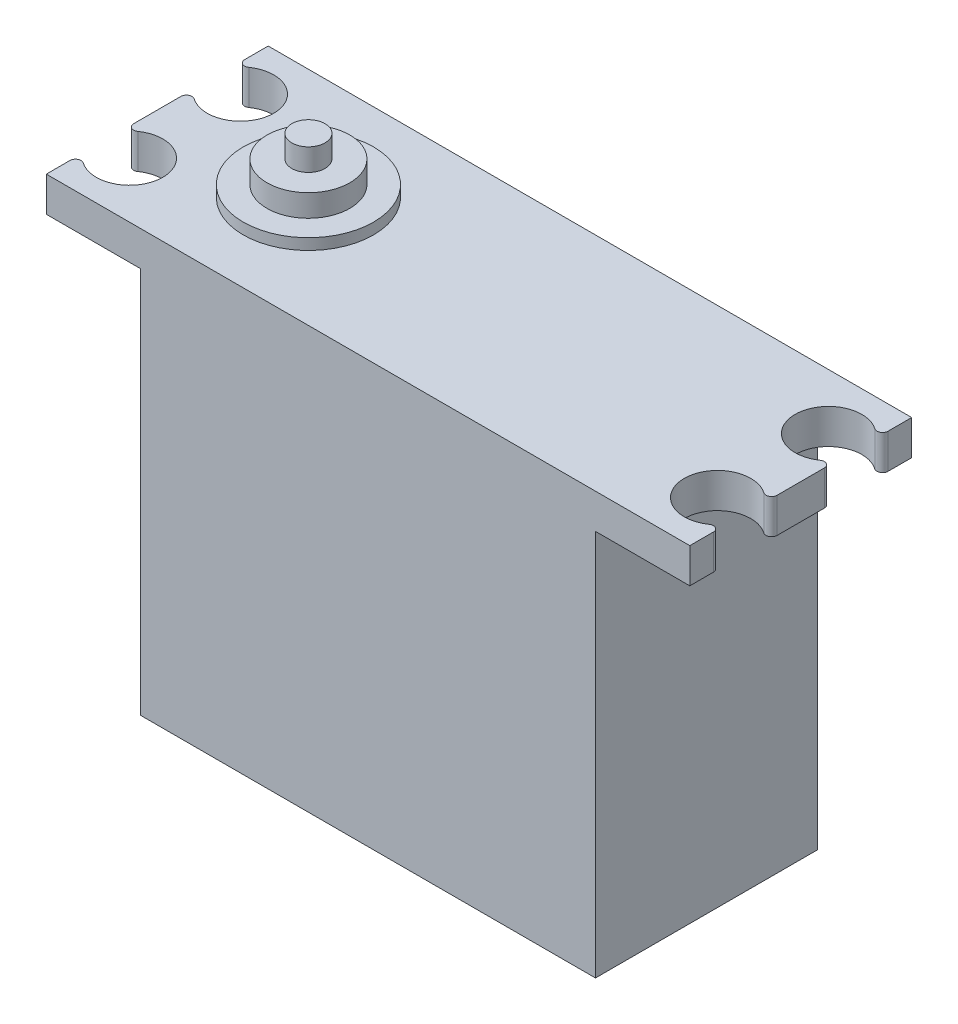
ISO-10303-21;
HEADER;
FILE_DESCRIPTION(('STEP AP214'),'2;1');
FILE_NAME('part.step','',(''),(''),'','','');
FILE_SCHEMA(('AUTOMOTIVE_DESIGN { 1 0 10303 214 1 1 1 1 }'));
ENDSEC;
DATA;
#1=APPLICATION_CONTEXT('core data for automotive mechanical design processes');
#2=APPLICATION_PROTOCOL_DEFINITION('international standard','automotive_design',2000,#1);
#3=PRODUCT_CONTEXT('',#1,'mechanical');
#4=PRODUCT('Part','Part','',(#3));
#5=PRODUCT_RELATED_PRODUCT_CATEGORY('part','',(#4));
#6=PRODUCT_DEFINITION_FORMATION('','',#4);
#7=PRODUCT_DEFINITION_CONTEXT('part definition',#1,'design');
#8=PRODUCT_DEFINITION('design','',#6,#7);
#9=PRODUCT_DEFINITION_SHAPE('','',#8);
#10=(LENGTH_UNIT() NAMED_UNIT(*) SI_UNIT(.MILLI.,.METRE.));
#11=(NAMED_UNIT(*) PLANE_ANGLE_UNIT() SI_UNIT($,.RADIAN.));
#12=(NAMED_UNIT(*) SI_UNIT($,.STERADIAN.) SOLID_ANGLE_UNIT());
#13=UNCERTAINTY_MEASURE_WITH_UNIT(LENGTH_MEASURE(1.E-05),#10,'distance_accuracy_value','');
#14=(GEOMETRIC_REPRESENTATION_CONTEXT(3) GLOBAL_UNCERTAINTY_ASSIGNED_CONTEXT((#13)) GLOBAL_UNIT_ASSIGNED_CONTEXT((#10,
#11,#12)) REPRESENTATION_CONTEXT('',''));
#15=CARTESIAN_POINT('',(0.,0.,0.));
#16=DIRECTION('',(0.,0.,1.));
#17=DIRECTION('',(1.,0.,0.));
#18=AXIS2_PLACEMENT_3D('',#15,#16,#17);
#19=CARTESIAN_POINT('',(-29.,19.,-20.));
#20=DIRECTION('',(-1.,0.,0.));
#21=DIRECTION('',(0.,0.,1.));
#22=AXIS2_PLACEMENT_3D('',#19,#20,#21);
#23=PLANE('',#22);
#24=DIRECTION('',(0.,0.,1.));
#25=VECTOR('',#24,1.);
#26=CARTESIAN_POINT('',(-29.,19.,-20.));
#27=LINE('',#26,#25);
#28=CARTESIAN_POINT('',(-29.,19.,-12.127718676731));
#29=VERTEX_POINT('',#28);
#30=CARTESIAN_POINT('',(-29.,19.,-7.87228132326901));
#31=VERTEX_POINT('',#30);
#32=EDGE_CURVE('E264',#29,#31,#27,.T.);
#33=ORIENTED_EDGE('',*,*,#32,.F.);
#34=DIRECTION('',(0.,-1.,0.));
#35=VECTOR('',#34,1.);
#36=CARTESIAN_POINT('',(-29.,15.8627330351919,-12.127718676731));
#37=LINE('',#36,#35);
#38=CARTESIAN_POINT('',(-29.,15.8627330351919,-12.127718676731));
#39=VERTEX_POINT('',#38);
#40=EDGE_CURVE('E326',#29,#39,#37,.T.);
#41=ORIENTED_EDGE('',*,*,#40,.T.);
#42=DIRECTION('',(0.,0.,1.));
#43=VECTOR('',#42,1.);
#44=CARTESIAN_POINT('',(-29.,15.8627330351919,-20.));
#45=LINE('',#44,#43);
#46=CARTESIAN_POINT('',(-29.,15.8627330351919,-7.87228132326901));
#47=VERTEX_POINT('',#46);
#48=EDGE_CURVE('E216',#39,#47,#45,.T.);
#49=ORIENTED_EDGE('',*,*,#48,.T.);
#50=DIRECTION('',(0.,-1.,0.));
#51=VECTOR('',#50,1.);
#52=CARTESIAN_POINT('',(-29.,19.,-7.87228132326901));
#53=LINE('',#52,#51);
#54=EDGE_CURVE('E324',#47,#31,#53,.F.);
#55=ORIENTED_EDGE('',*,*,#54,.T.);
#56=EDGE_LOOP('',(#33,#41,#49,#55));
#57=FACE_BOUND('',#56,.T.);
#58=ADVANCED_FACE('F34',(#57),#23,.T.);
#59=CARTESIAN_POINT('',(-29.,19.,-2.127718676731));
#60=VERTEX_POINT('',#59);
#61=CARTESIAN_POINT('',(-29.,19.,0.));
#62=VERTEX_POINT('',#61);
#63=EDGE_CURVE('E265',#60,#62,#27,.T.);
#64=ORIENTED_EDGE('',*,*,#63,.F.);
#65=DIRECTION('',(0.,-1.,0.));
#66=VECTOR('',#65,1.);
#67=CARTESIAN_POINT('',(-29.,15.8627330351919,-2.12771867673099));
#68=LINE('',#67,#66);
#69=CARTESIAN_POINT('',(-29.,15.8627330351919,-2.127718676731));
#70=VERTEX_POINT('',#69);
#71=EDGE_CURVE('E334',#60,#70,#68,.T.);
#72=ORIENTED_EDGE('',*,*,#71,.T.);
#73=CARTESIAN_POINT('',(-29.,15.8627330351919,0.));
#74=VERTEX_POINT('',#73);
#75=EDGE_CURVE('E218',#70,#74,#45,.T.);
#76=ORIENTED_EDGE('',*,*,#75,.T.);
#77=DIRECTION('',(0.,-1.,0.));
#78=VECTOR('',#77,1.);
#79=CARTESIAN_POINT('',(-29.,19.,0.));
#80=LINE('',#79,#78);
#81=EDGE_CURVE('E244',#62,#74,#80,.T.);
#82=ORIENTED_EDGE('',*,*,#81,.F.);
#83=EDGE_LOOP('',(#64,#72,#76,#82));
#84=FACE_BOUND('',#83,.T.);
#85=ADVANCED_FACE('F453',(#84),#23,.T.);
#86=CARTESIAN_POINT('',(29.,19.,-20.));
#87=DIRECTION('',(-1.,0.,0.));
#88=DIRECTION('',(0.,0.,1.));
#89=AXIS2_PLACEMENT_3D('',#86,#87,#88);
#90=PLANE('',#89);
#91=DIRECTION('',(0.,0.,1.));
#92=VECTOR('',#91,1.);
#93=CARTESIAN_POINT('',(29.,15.8627330351919,-20.));
#94=LINE('',#93,#92);
#95=CARTESIAN_POINT('',(29.,15.8627330351919,-12.127718676731));
#96=VERTEX_POINT('',#95);
#97=CARTESIAN_POINT('',(29.,15.8627330351919,-7.87228132326901));
#98=VERTEX_POINT('',#97);
#99=EDGE_CURVE('E274',#96,#98,#94,.T.);
#100=ORIENTED_EDGE('',*,*,#99,.F.);
#101=DIRECTION('',(0.,1.,0.));
#102=VECTOR('',#101,1.);
#103=CARTESIAN_POINT('',(29.,19.,-12.127718676731));
#104=LINE('',#103,#102);
#105=CARTESIAN_POINT('',(29.,19.,-12.127718676731));
#106=VERTEX_POINT('',#105);
#107=EDGE_CURVE('E339',#96,#106,#104,.T.);
#108=ORIENTED_EDGE('',*,*,#107,.T.);
#109=DIRECTION('',(0.,0.,1.));
#110=VECTOR('',#109,1.);
#111=CARTESIAN_POINT('',(29.,19.,-20.));
#112=LINE('',#111,#110);
#113=CARTESIAN_POINT('',(29.,19.,-7.87228132326901));
#114=VERTEX_POINT('',#113);
#115=EDGE_CURVE('E269',#106,#114,#112,.T.);
#116=ORIENTED_EDGE('',*,*,#115,.T.);
#117=DIRECTION('',(0.,1.,0.));
#118=VECTOR('',#117,1.);
#119=CARTESIAN_POINT('',(29.,19.,-7.87228132326901));
#120=LINE('',#119,#118);
#121=EDGE_CURVE('E336',#114,#98,#120,.F.);
#122=ORIENTED_EDGE('',*,*,#121,.T.);
#123=EDGE_LOOP('',(#100,#108,#116,#122));
#124=FACE_BOUND('',#123,.T.);
#125=ADVANCED_FACE('F374',(#124),#90,.F.);
#126=CARTESIAN_POINT('',(29.,15.8627330351919,-2.12771867673099));
#127=VERTEX_POINT('',#126);
#128=CARTESIAN_POINT('',(29.,15.8627330351919,0.));
#129=VERTEX_POINT('',#128);
#130=EDGE_CURVE('E275',#127,#129,#94,.T.);
#131=ORIENTED_EDGE('',*,*,#130,.F.);
#132=DIRECTION('',(0.,1.,0.));
#133=VECTOR('',#132,1.);
#134=CARTESIAN_POINT('',(29.,19.,-2.12771867673099));
#135=LINE('',#134,#133);
#136=CARTESIAN_POINT('',(29.,19.,-2.12771867673099));
#137=VERTEX_POINT('',#136);
#138=EDGE_CURVE('E42',#127,#137,#135,.T.);
#139=ORIENTED_EDGE('',*,*,#138,.T.);
#140=CARTESIAN_POINT('',(29.,19.,0.));
#141=VERTEX_POINT('',#140);
#142=EDGE_CURVE('E270',#137,#141,#112,.T.);
#143=ORIENTED_EDGE('',*,*,#142,.T.);
#144=DIRECTION('',(0.,-1.,0.));
#145=VECTOR('',#144,1.);
#146=CARTESIAN_POINT('',(29.,19.,0.));
#147=LINE('',#146,#145);
#148=EDGE_CURVE('E226',#141,#129,#147,.T.);
#149=ORIENTED_EDGE('',*,*,#148,.T.);
#150=EDGE_LOOP('',(#131,#139,#143,#149));
#151=FACE_BOUND('',#150,.T.);
#152=ADVANCED_FACE('F362',(#151),#90,.F.);
#153=CARTESIAN_POINT('',(-29.,15.8627330351919,-20.));
#154=VERTEX_POINT('',#153);
#155=CARTESIAN_POINT('',(-29.,15.8627330351919,-17.872281323269));
#156=VERTEX_POINT('',#155);
#157=EDGE_CURVE('E209',#154,#156,#45,.T.);
#158=ORIENTED_EDGE('',*,*,#157,.T.);
#159=DIRECTION('',(0.,-1.,0.));
#160=VECTOR('',#159,1.);
#161=CARTESIAN_POINT('',(-29.,19.,-17.872281323269));
#162=LINE('',#161,#160);
#163=CARTESIAN_POINT('',(-29.,19.,-17.872281323269));
#164=VERTEX_POINT('',#163);
#165=EDGE_CURVE('E306',#156,#164,#162,.F.);
#166=ORIENTED_EDGE('',*,*,#165,.T.);
#167=CARTESIAN_POINT('',(-29.,19.,-20.));
#168=VERTEX_POINT('',#167);
#169=EDGE_CURVE('E221',#168,#164,#27,.T.);
#170=ORIENTED_EDGE('',*,*,#169,.F.);
#171=DIRECTION('',(0.,-1.,0.));
#172=VECTOR('',#171,1.);
#173=CARTESIAN_POINT('',(-29.,19.,-20.));
#174=LINE('',#173,#172);
#175=EDGE_CURVE('E201',#168,#154,#174,.T.);
#176=ORIENTED_EDGE('',*,*,#175,.T.);
#177=EDGE_LOOP('',(#158,#166,#170,#176));
#178=FACE_BOUND('',#177,.T.);
#179=ADVANCED_FACE('F219',(#178),#23,.T.);
#180=CARTESIAN_POINT('',(-29.,19.,-20.));
#181=DIRECTION('',(0.,-1.,0.));
#182=DIRECTION('',(1.,0.,0.));
#183=AXIS2_PLACEMENT_3D('',#180,#181,#182);
#184=PLANE('',#183);
#185=CARTESIAN_POINT('',(-15.3757931844889,19.,-10.));
#186=DIRECTION('',(0.,-1.,0.));
#187=DIRECTION('',(1.,0.,0.));
#188=AXIS2_PLACEMENT_3D('',#185,#186,#187);
#189=CIRCLE('',#188,5.87207867230453);
#190=CARTESIAN_POINT('',(-9.50371451218433,19.,-10.));
#191=VERTEX_POINT('',#190);
#192=EDGE_CURVE('E11',#191,#191,#189,.F.);
#193=ORIENTED_EDGE('',*,*,#192,.F.);
#194=EDGE_LOOP('',(#193));
#195=FACE_BOUND('',#194,.T.);
#196=ORIENTED_EDGE('',*,*,#169,.T.);
#197=CARTESIAN_POINT('',(-28.5,19.,-17.872281323269));
#198=DIRECTION('',(0.,-1.,0.));
#199=DIRECTION('',(1.,0.,0.));
#200=AXIS2_PLACEMENT_3D('',#197,#198,#199);
#201=CIRCLE('',#200,0.5);
#202=CARTESIAN_POINT('',(-28.2142857142857,19.,-17.4619554199449));
#203=VERTEX_POINT('',#202);
#204=EDGE_CURVE('E322',#164,#203,#201,.F.);
#205=ORIENTED_EDGE('',*,*,#204,.T.);
#206=CARTESIAN_POINT('',(-26.5,19.,-15.));
#207=DIRECTION('',(0.,1.,0.));
#208=DIRECTION('',(-1.,0.,0.));
#209=AXIS2_PLACEMENT_3D('',#206,#207,#208);
#210=CIRCLE('',#209,3.);
#211=CARTESIAN_POINT('',(-28.2142857142857,19.,-12.5380445800551));
#212=VERTEX_POINT('',#211);
#213=EDGE_CURVE('E390',#212,#203,#210,.T.);
#214=ORIENTED_EDGE('',*,*,#213,.F.);
#215=CARTESIAN_POINT('',(-28.5,19.,-12.127718676731));
#216=DIRECTION('',(0.,-1.,0.));
#217=DIRECTION('',(1.,0.,0.));
#218=AXIS2_PLACEMENT_3D('',#215,#216,#217);
#219=CIRCLE('',#218,0.5);
#220=EDGE_CURVE('E320',#212,#29,#219,.F.);
#221=ORIENTED_EDGE('',*,*,#220,.T.);
#222=ORIENTED_EDGE('',*,*,#32,.T.);
#223=CARTESIAN_POINT('',(-28.5,19.,-7.87228132326901));
#224=DIRECTION('',(0.,-1.,0.));
#225=DIRECTION('',(1.,0.,0.));
#226=AXIS2_PLACEMENT_3D('',#223,#224,#225);
#227=CIRCLE('',#226,0.5);
#228=CARTESIAN_POINT('',(-28.2142857142857,19.,-7.46195541994487));
#229=VERTEX_POINT('',#228);
#230=EDGE_CURVE('E318',#31,#229,#227,.F.);
#231=ORIENTED_EDGE('',*,*,#230,.T.);
#232=CARTESIAN_POINT('',(-26.5,19.,-5.));
#233=DIRECTION('',(0.,1.,0.));
#234=DIRECTION('',(1.,0.,0.));
#235=AXIS2_PLACEMENT_3D('',#232,#233,#234);
#236=CIRCLE('',#235,3.);
#237=CARTESIAN_POINT('',(-28.2142857142857,19.,-2.53804458005514));
#238=VERTEX_POINT('',#237);
#239=EDGE_CURVE('E385',#238,#229,#236,.T.);
#240=ORIENTED_EDGE('',*,*,#239,.F.);
#241=CARTESIAN_POINT('',(-28.5,19.,-2.12771867673099));
#242=DIRECTION('',(0.,-1.,0.));
#243=DIRECTION('',(1.,0.,0.));
#244=AXIS2_PLACEMENT_3D('',#241,#242,#243);
#245=CIRCLE('',#244,0.5);
#246=EDGE_CURVE('E316',#238,#60,#245,.F.);
#247=ORIENTED_EDGE('',*,*,#246,.T.);
#248=ORIENTED_EDGE('',*,*,#63,.T.);
#249=DIRECTION('',(1.,0.,0.));
#250=VECTOR('',#249,1.);
#251=CARTESIAN_POINT('',(-29.,19.,0.));
#252=LINE('',#251,#250);
#253=EDGE_CURVE('E223',#62,#141,#252,.T.);
#254=ORIENTED_EDGE('',*,*,#253,.T.);
#255=ORIENTED_EDGE('',*,*,#142,.F.);
#256=CARTESIAN_POINT('',(28.5,19.,-2.12771867673099));
#257=DIRECTION('',(0.,-1.,0.));
#258=DIRECTION('',(1.,0.,0.));
#259=AXIS2_PLACEMENT_3D('',#256,#257,#258);
#260=CIRCLE('',#259,0.5);
#261=CARTESIAN_POINT('',(28.2142857142857,19.,-2.53804458005513));
#262=VERTEX_POINT('',#261);
#263=EDGE_CURVE('E308',#137,#262,#260,.F.);
#264=ORIENTED_EDGE('',*,*,#263,.T.);
#265=CARTESIAN_POINT('',(26.5,19.,-5.));
#266=DIRECTION('',(0.,1.,0.));
#267=DIRECTION('',(-1.,0.,0.));
#268=AXIS2_PLACEMENT_3D('',#265,#266,#267);
#269=CIRCLE('',#268,3.);
#270=CARTESIAN_POINT('',(28.2142857142857,19.,-7.46195541994487));
#271=VERTEX_POINT('',#270);
#272=EDGE_CURVE('E229',#271,#262,#269,.T.);
#273=ORIENTED_EDGE('',*,*,#272,.F.);
#274=CARTESIAN_POINT('',(28.5,19.,-7.87228132326901));
#275=DIRECTION('',(0.,-1.,0.));
#276=DIRECTION('',(1.,0.,0.));
#277=AXIS2_PLACEMENT_3D('',#274,#275,#276);
#278=CIRCLE('',#277,0.5);
#279=EDGE_CURVE('E310',#271,#114,#278,.F.);
#280=ORIENTED_EDGE('',*,*,#279,.T.);
#281=ORIENTED_EDGE('',*,*,#115,.F.);
#282=CARTESIAN_POINT('',(28.5,19.,-12.127718676731));
#283=DIRECTION('',(0.,-1.,0.));
#284=DIRECTION('',(1.,0.,0.));
#285=AXIS2_PLACEMENT_3D('',#282,#283,#284);
#286=CIRCLE('',#285,0.5);
#287=CARTESIAN_POINT('',(28.2142857142857,19.,-12.5380445800551));
#288=VERTEX_POINT('',#287);
#289=EDGE_CURVE('E314',#106,#288,#286,.F.);
#290=ORIENTED_EDGE('',*,*,#289,.T.);
#291=CARTESIAN_POINT('',(26.5,19.,-15.));
#292=DIRECTION('',(0.,1.,0.));
#293=DIRECTION('',(1.,0.,0.));
#294=AXIS2_PLACEMENT_3D('',#291,#292,#293);
#295=CIRCLE('',#294,3.);
#296=CARTESIAN_POINT('',(28.2142857142857,19.,-17.4619554199449));
#297=VERTEX_POINT('',#296);
#298=EDGE_CURVE('E383',#297,#288,#295,.T.);
#299=ORIENTED_EDGE('',*,*,#298,.F.);
#300=CARTESIAN_POINT('',(28.5,19.,-17.872281323269));
#301=DIRECTION('',(0.,-1.,0.));
#302=DIRECTION('',(1.,0.,0.));
#303=AXIS2_PLACEMENT_3D('',#300,#301,#302);
#304=CIRCLE('',#303,0.5);
#305=CARTESIAN_POINT('',(29.,19.,-17.872281323269));
#306=VERTEX_POINT('',#305);
#307=EDGE_CURVE('E312',#297,#306,#304,.F.);
#308=ORIENTED_EDGE('',*,*,#307,.T.);
#309=CARTESIAN_POINT('',(29.,19.,-20.));
#310=VERTEX_POINT('',#309);
#311=EDGE_CURVE('E266',#310,#306,#112,.T.);
#312=ORIENTED_EDGE('',*,*,#311,.F.);
#313=DIRECTION('',(1.,0.,0.));
#314=VECTOR('',#313,1.);
#315=CARTESIAN_POINT('',(-29.,19.,-20.));
#316=LINE('',#315,#314);
#317=EDGE_CURVE('E242',#168,#310,#316,.T.);
#318=ORIENTED_EDGE('',*,*,#317,.F.);
#319=EDGE_LOOP('',(#196,#205,#214,#221,#222,#231,#240,#247,#248,#254,#255,#264,#273,#280,#281,
#290,#299,#308,#312,#318));
#320=FACE_BOUND('',#319,.T.);
#321=ADVANCED_FACE('F365',(#195,#320),#184,.F.);
#322=ORIENTED_EDGE('',*,*,#311,.T.);
#323=DIRECTION('',(0.,1.,0.));
#324=VECTOR('',#323,1.);
#325=CARTESIAN_POINT('',(29.,19.,-17.872281323269));
#326=LINE('',#325,#324);
#327=CARTESIAN_POINT('',(29.,15.8627330351919,-17.872281323269));
#328=VERTEX_POINT('',#327);
#329=EDGE_CURVE('E353',#306,#328,#326,.F.);
#330=ORIENTED_EDGE('',*,*,#329,.T.);
#331=CARTESIAN_POINT('',(29.,15.8627330351919,-20.));
#332=VERTEX_POINT('',#331);
#333=EDGE_CURVE('E271',#332,#328,#94,.T.);
#334=ORIENTED_EDGE('',*,*,#333,.F.);
#335=DIRECTION('',(0.,-1.,0.));
#336=VECTOR('',#335,1.);
#337=CARTESIAN_POINT('',(29.,19.,-20.));
#338=LINE('',#337,#336);
#339=EDGE_CURVE('E240',#310,#332,#338,.T.);
#340=ORIENTED_EDGE('',*,*,#339,.F.);
#341=EDGE_LOOP('',(#322,#330,#334,#340));
#342=FACE_BOUND('',#341,.T.);
#343=ADVANCED_FACE('F444',(#342),#90,.F.);
#344=CARTESIAN_POINT('',(29.,15.8627330351919,-20.));
#345=DIRECTION('',(0.,1.,0.));
#346=DIRECTION('',(-1.,0.,0.));
#347=AXIS2_PLACEMENT_3D('',#344,#345,#346);
#348=PLANE('',#347);
#349=CARTESIAN_POINT('',(26.5,15.8627330351919,-15.));
#350=DIRECTION('',(0.,1.,0.));
#351=DIRECTION('',(-1.,0.,0.));
#352=AXIS2_PLACEMENT_3D('',#349,#350,#351);
#353=CIRCLE('',#352,3.);
#354=CARTESIAN_POINT('',(28.2142857142857,15.8627330351919,-17.4619554199449));
#355=VERTEX_POINT('',#354);
#356=CARTESIAN_POINT('',(28.2142857142857,15.8627330351919,-12.5380445800551));
#357=VERTEX_POINT('',#356);
#358=EDGE_CURVE('E285',#355,#357,#353,.T.);
#359=ORIENTED_EDGE('',*,*,#358,.T.);
#360=CARTESIAN_POINT('',(28.5,15.8627330351919,-12.127718676731));
#361=DIRECTION('',(0.,1.,0.));
#362=DIRECTION('',(-1.,0.,0.));
#363=AXIS2_PLACEMENT_3D('',#360,#361,#362);
#364=CIRCLE('',#363,0.5);
#365=EDGE_CURVE('E351',#357,#96,#364,.F.);
#366=ORIENTED_EDGE('',*,*,#365,.T.);
#367=ORIENTED_EDGE('',*,*,#99,.T.);
#368=CARTESIAN_POINT('',(28.5,15.8627330351919,-7.87228132326901));
#369=DIRECTION('',(0.,1.,0.));
#370=DIRECTION('',(-1.,0.,0.));
#371=AXIS2_PLACEMENT_3D('',#368,#369,#370);
#372=CIRCLE('',#371,0.5);
#373=CARTESIAN_POINT('',(28.2142857142857,15.8627330351919,-7.46195541994487));
#374=VERTEX_POINT('',#373);
#375=EDGE_CURVE('E347',#98,#374,#372,.F.);
#376=ORIENTED_EDGE('',*,*,#375,.T.);
#377=CARTESIAN_POINT('',(26.5,15.8627330351919,-5.));
#378=DIRECTION('',(0.,1.,0.));
#379=DIRECTION('',(-1.,0.,0.));
#380=AXIS2_PLACEMENT_3D('',#377,#378,#379);
#381=CIRCLE('',#380,3.);
#382=CARTESIAN_POINT('',(28.2142857142857,15.8627330351919,-2.53804458005513));
#383=VERTEX_POINT('',#382);
#384=EDGE_CURVE('E263',#374,#383,#381,.T.);
#385=ORIENTED_EDGE('',*,*,#384,.T.);
#386=CARTESIAN_POINT('',(28.5,15.8627330351919,-2.12771867673099));
#387=DIRECTION('',(0.,1.,0.));
#388=DIRECTION('',(-1.,0.,0.));
#389=AXIS2_PLACEMENT_3D('',#386,#387,#388);
#390=CIRCLE('',#389,0.5);
#391=EDGE_CURVE('E49',#383,#127,#390,.F.);
#392=ORIENTED_EDGE('',*,*,#391,.T.);
#393=ORIENTED_EDGE('',*,*,#130,.T.);
#394=DIRECTION('',(-1.,0.,0.));
#395=VECTOR('',#394,1.);
#396=CARTESIAN_POINT('',(29.,15.8627330351919,0.));
#397=LINE('',#396,#395);
#398=CARTESIAN_POINT('',(20.5,15.8627330351919,0.));
#399=VERTEX_POINT('',#398);
#400=EDGE_CURVE('E257',#129,#399,#397,.T.);
#401=ORIENTED_EDGE('',*,*,#400,.T.);
#402=DIRECTION('',(0.,0.,1.));
#403=VECTOR('',#402,1.);
#404=CARTESIAN_POINT('',(20.5,15.8627330351919,-20.));
#405=LINE('',#404,#403);
#406=CARTESIAN_POINT('',(20.5,15.8627330351919,-20.));
#407=VERTEX_POINT('',#406);
#408=EDGE_CURVE('E276',#407,#399,#405,.T.);
#409=ORIENTED_EDGE('',*,*,#408,.F.);
#410=DIRECTION('',(-1.,0.,0.));
#411=VECTOR('',#410,1.);
#412=CARTESIAN_POINT('',(29.,15.8627330351919,-20.));
#413=LINE('',#412,#411);
#414=EDGE_CURVE('E238',#332,#407,#413,.T.);
#415=ORIENTED_EDGE('',*,*,#414,.F.);
#416=ORIENTED_EDGE('',*,*,#333,.T.);
#417=CARTESIAN_POINT('',(28.5,15.8627330351919,-17.872281323269));
#418=DIRECTION('',(0.,1.,0.));
#419=DIRECTION('',(-1.,0.,0.));
#420=AXIS2_PLACEMENT_3D('',#417,#418,#419);
#421=CIRCLE('',#420,0.5);
#422=EDGE_CURVE('E349',#328,#355,#421,.F.);
#423=ORIENTED_EDGE('',*,*,#422,.T.);
#424=EDGE_LOOP('',(#359,#366,#367,#376,#385,#392,#393,#401,#409,#415,#416,#423));
#425=FACE_BOUND('',#424,.T.);
#426=ADVANCED_FACE('F381',(#425),#348,.F.);
#427=CARTESIAN_POINT('',(20.5,-19.,-20.));
#428=DIRECTION('',(1.,0.,0.));
#429=DIRECTION('',(0.,0.,-1.));
#430=AXIS2_PLACEMENT_3D('',#427,#428,#429);
#431=PLANE('',#430);
#432=DIRECTION('',(0.,1.,0.));
#433=VECTOR('',#432,1.);
#434=CARTESIAN_POINT('',(20.5,-19.,0.));
#435=LINE('',#434,#433);
#436=CARTESIAN_POINT('',(20.5,-19.,0.));
#437=VERTEX_POINT('',#436);
#438=EDGE_CURVE('E254',#437,#399,#435,.T.);
#439=ORIENTED_EDGE('',*,*,#438,.F.);
#440=DIRECTION('',(0.,0.,1.));
#441=VECTOR('',#440,1.);
#442=CARTESIAN_POINT('',(20.5,-19.,-20.));
#443=LINE('',#442,#441);
#444=CARTESIAN_POINT('',(20.5,-19.,-20.));
#445=VERTEX_POINT('',#444);
#446=EDGE_CURVE('E278',#445,#437,#443,.T.);
#447=ORIENTED_EDGE('',*,*,#446,.F.);
#448=DIRECTION('',(0.,1.,0.));
#449=VECTOR('',#448,1.);
#450=CARTESIAN_POINT('',(20.5,-19.,-20.));
#451=LINE('',#450,#449);
#452=EDGE_CURVE('E235',#445,#407,#451,.T.);
#453=ORIENTED_EDGE('',*,*,#452,.T.);
#454=ORIENTED_EDGE('',*,*,#408,.T.);
#455=EDGE_LOOP('',(#439,#447,#453,#454));
#456=FACE_BOUND('',#455,.T.);
#457=ADVANCED_FACE('F669',(#456),#431,.T.);
#458=CARTESIAN_POINT('',(20.5,-19.,-20.));
#459=DIRECTION('',(0.,1.,0.));
#460=DIRECTION('',(-1.,0.,0.));
#461=AXIS2_PLACEMENT_3D('',#458,#459,#460);
#462=PLANE('',#461);
#463=DIRECTION('',(-1.,0.,0.));
#464=VECTOR('',#463,1.);
#465=CARTESIAN_POINT('',(20.5,-19.,0.));
#466=LINE('',#465,#464);
#467=CARTESIAN_POINT('',(-20.5,-19.,0.));
#468=VERTEX_POINT('',#467);
#469=EDGE_CURVE('E252',#437,#468,#466,.T.);
#470=ORIENTED_EDGE('',*,*,#469,.T.);
#471=DIRECTION('',(0.,0.,1.));
#472=VECTOR('',#471,1.);
#473=CARTESIAN_POINT('',(-20.5,-19.,-20.));
#474=LINE('',#473,#472);
#475=CARTESIAN_POINT('',(-20.5,-19.,-20.));
#476=VERTEX_POINT('',#475);
#477=EDGE_CURVE('E280',#476,#468,#474,.T.);
#478=ORIENTED_EDGE('',*,*,#477,.F.);
#479=DIRECTION('',(-1.,0.,0.));
#480=VECTOR('',#479,1.);
#481=CARTESIAN_POINT('',(20.5,-19.,-20.));
#482=LINE('',#481,#480);
#483=EDGE_CURVE('E233',#445,#476,#482,.T.);
#484=ORIENTED_EDGE('',*,*,#483,.F.);
#485=ORIENTED_EDGE('',*,*,#446,.T.);
#486=EDGE_LOOP('',(#470,#478,#484,#485));
#487=FACE_BOUND('',#486,.T.);
#488=ADVANCED_FACE('F660',(#487),#462,.F.);
#489=CARTESIAN_POINT('',(-20.5,-19.,-20.));
#490=DIRECTION('',(1.,0.,0.));
#491=DIRECTION('',(0.,1.,0.));
#492=AXIS2_PLACEMENT_3D('',#489,#490,#491);
#493=PLANE('',#492);
#494=DIRECTION('',(0.,1.,0.));
#495=VECTOR('',#494,1.);
#496=CARTESIAN_POINT('',(-20.5,-19.,0.));
#497=LINE('',#496,#495);
#498=CARTESIAN_POINT('',(-20.5,15.8627330351919,0.));
#499=VERTEX_POINT('',#498);
#500=EDGE_CURVE('E250',#468,#499,#497,.T.);
#501=ORIENTED_EDGE('',*,*,#500,.T.);
#502=DIRECTION('',(0.,0.,1.));
#503=VECTOR('',#502,1.);
#504=CARTESIAN_POINT('',(-20.5,15.8627330351919,-20.));
#505=LINE('',#504,#503);
#506=CARTESIAN_POINT('',(-20.5,15.8627330351919,-20.));
#507=VERTEX_POINT('',#506);
#508=EDGE_CURVE('E215',#507,#499,#505,.T.);
#509=ORIENTED_EDGE('',*,*,#508,.F.);
#510=DIRECTION('',(0.,1.,0.));
#511=VECTOR('',#510,1.);
#512=CARTESIAN_POINT('',(-20.5,-19.,-20.));
#513=LINE('',#512,#511);
#514=EDGE_CURVE('E203',#476,#507,#513,.T.);
#515=ORIENTED_EDGE('',*,*,#514,.F.);
#516=ORIENTED_EDGE('',*,*,#477,.T.);
#517=EDGE_LOOP('',(#501,#509,#515,#516));
#518=FACE_BOUND('',#517,.T.);
#519=ADVANCED_FACE('F652',(#518),#493,.F.);
#520=CARTESIAN_POINT('',(-20.5,15.8627330351919,-20.));
#521=DIRECTION('',(0.,1.,0.));
#522=DIRECTION('',(-1.,0.,0.));
#523=AXIS2_PLACEMENT_3D('',#520,#521,#522);
#524=PLANE('',#523);
#525=CARTESIAN_POINT('',(-26.5,15.8627330351919,-15.));
#526=DIRECTION('',(0.,1.,0.));
#527=DIRECTION('',(-1.,0.,0.));
#528=AXIS2_PLACEMENT_3D('',#525,#526,#527);
#529=CIRCLE('',#528,3.);
#530=CARTESIAN_POINT('',(-28.2142857142857,15.8627330351919,-12.5380445800551));
#531=VERTEX_POINT('',#530);
#532=CARTESIAN_POINT('',(-28.2142857142857,15.8627330351919,-17.4619554199449));
#533=VERTEX_POINT('',#532);
#534=EDGE_CURVE('E291',#531,#533,#529,.T.);
#535=ORIENTED_EDGE('',*,*,#534,.T.);
#536=CARTESIAN_POINT('',(-28.5,15.8627330351919,-17.872281323269));
#537=DIRECTION('',(0.,1.,0.));
#538=DIRECTION('',(-1.,0.,0.));
#539=AXIS2_PLACEMENT_3D('',#536,#537,#538);
#540=CIRCLE('',#539,0.5);
#541=EDGE_CURVE('E212',#533,#156,#540,.F.);
#542=ORIENTED_EDGE('',*,*,#541,.T.);
#543=ORIENTED_EDGE('',*,*,#157,.F.);
#544=DIRECTION('',(-1.,0.,0.));
#545=VECTOR('',#544,1.);
#546=CARTESIAN_POINT('',(-20.5,15.8627330351919,-20.));
#547=LINE('',#546,#545);
#548=EDGE_CURVE('E197',#507,#154,#547,.T.);
#549=ORIENTED_EDGE('',*,*,#548,.F.);
#550=ORIENTED_EDGE('',*,*,#508,.T.);
#551=DIRECTION('',(-1.,0.,0.));
#552=VECTOR('',#551,1.);
#553=CARTESIAN_POINT('',(-20.5,15.8627330351919,0.));
#554=LINE('',#553,#552);
#555=EDGE_CURVE('E247',#499,#74,#554,.T.);
#556=ORIENTED_EDGE('',*,*,#555,.T.);
#557=ORIENTED_EDGE('',*,*,#75,.F.);
#558=CARTESIAN_POINT('',(-28.5,15.8627330351919,-2.12771867673099));
#559=DIRECTION('',(0.,1.,0.));
#560=DIRECTION('',(-1.,0.,0.));
#561=AXIS2_PLACEMENT_3D('',#558,#559,#560);
#562=CIRCLE('',#561,0.5);
#563=CARTESIAN_POINT('',(-28.2142857142857,15.8627330351919,-2.53804458005514));
#564=VERTEX_POINT('',#563);
#565=EDGE_CURVE('E299',#70,#564,#562,.F.);
#566=ORIENTED_EDGE('',*,*,#565,.T.);
#567=CARTESIAN_POINT('',(-26.5,15.8627330351919,-5.));
#568=DIRECTION('',(0.,1.,0.));
#569=DIRECTION('',(-1.,0.,0.));
#570=AXIS2_PLACEMENT_3D('',#567,#568,#569);
#571=CIRCLE('',#570,3.);
#572=CARTESIAN_POINT('',(-28.2142857142857,15.8627330351919,-7.46195541994487));
#573=VERTEX_POINT('',#572);
#574=EDGE_CURVE('E288',#564,#573,#571,.T.);
#575=ORIENTED_EDGE('',*,*,#574,.T.);
#576=CARTESIAN_POINT('',(-28.5,15.8627330351919,-7.87228132326901));
#577=DIRECTION('',(0.,1.,0.));
#578=DIRECTION('',(-1.,0.,0.));
#579=AXIS2_PLACEMENT_3D('',#576,#577,#578);
#580=CIRCLE('',#579,0.5);
#581=EDGE_CURVE('E301',#573,#47,#580,.F.);
#582=ORIENTED_EDGE('',*,*,#581,.T.);
#583=ORIENTED_EDGE('',*,*,#48,.F.);
#584=CARTESIAN_POINT('',(-28.5,15.8627330351919,-12.127718676731));
#585=DIRECTION('',(0.,1.,0.));
#586=DIRECTION('',(-1.,0.,0.));
#587=AXIS2_PLACEMENT_3D('',#584,#585,#586);
#588=CIRCLE('',#587,0.5);
#589=EDGE_CURVE('E303',#39,#531,#588,.F.);
#590=ORIENTED_EDGE('',*,*,#589,.T.);
#591=EDGE_LOOP('',(#535,#542,#543,#549,#550,#556,#557,#566,#575,#582,#583,#590));
#592=FACE_BOUND('',#591,.T.);
#593=ADVANCED_FACE('F211',(#592),#524,.F.);
#594=CARTESIAN_POINT('',(0.,0.,-20.));
#595=DIRECTION('',(0.,0.,-1.));
#596=DIRECTION('',(-1.,0.,0.));
#597=AXIS2_PLACEMENT_3D('',#594,#595,#596);
#598=PLANE('',#597);
#599=ORIENTED_EDGE('',*,*,#175,.F.);
#600=ORIENTED_EDGE('',*,*,#317,.T.);
#601=ORIENTED_EDGE('',*,*,#339,.T.);
#602=ORIENTED_EDGE('',*,*,#414,.T.);
#603=ORIENTED_EDGE('',*,*,#452,.F.);
#604=ORIENTED_EDGE('',*,*,#483,.T.);
#605=ORIENTED_EDGE('',*,*,#514,.T.);
#606=ORIENTED_EDGE('',*,*,#548,.T.);
#607=EDGE_LOOP('',(#599,#600,#601,#602,#603,#604,#605,#606));
#608=FACE_BOUND('',#607,.T.);
#609=ADVANCED_FACE('F199',(#608),#598,.T.);
#610=CARTESIAN_POINT('',(0.,0.,0.));
#611=DIRECTION('',(0.,0.,-1.));
#612=DIRECTION('',(-1.,0.,0.));
#613=AXIS2_PLACEMENT_3D('',#610,#611,#612);
#614=PLANE('',#613);
#615=ORIENTED_EDGE('',*,*,#81,.T.);
#616=ORIENTED_EDGE('',*,*,#555,.F.);
#617=ORIENTED_EDGE('',*,*,#500,.F.);
#618=ORIENTED_EDGE('',*,*,#469,.F.);
#619=ORIENTED_EDGE('',*,*,#438,.T.);
#620=ORIENTED_EDGE('',*,*,#400,.F.);
#621=ORIENTED_EDGE('',*,*,#148,.F.);
#622=ORIENTED_EDGE('',*,*,#253,.F.);
#623=EDGE_LOOP('',(#615,#616,#617,#618,#619,#620,#621,#622));
#624=FACE_BOUND('',#623,.T.);
#625=ADVANCED_FACE('F606',(#624),#614,.F.);
#626=CARTESIAN_POINT('',(26.5,-19.,-5.));
#627=DIRECTION('',(0.,1.,0.));
#628=DIRECTION('',(-1.,0.,0.));
#629=AXIS2_PLACEMENT_3D('',#626,#627,#628);
#630=CYLINDRICAL_SURFACE('',#629,3.);
#631=ORIENTED_EDGE('',*,*,#384,.F.);
#632=DIRECTION('',(0.,1.,0.));
#633=VECTOR('',#632,1.);
#634=CARTESIAN_POINT('',(28.2142857142857,-19.,-7.46195541994487));
#635=LINE('',#634,#633);
#636=EDGE_CURVE('E357',#374,#271,#635,.T.);
#637=ORIENTED_EDGE('',*,*,#636,.T.);
#638=ORIENTED_EDGE('',*,*,#272,.T.);
#639=DIRECTION('',(0.,1.,0.));
#640=VECTOR('',#639,1.);
#641=CARTESIAN_POINT('',(28.2142857142857,-19.,-2.53804458005513));
#642=LINE('',#641,#640);
#643=EDGE_CURVE('E57',#262,#383,#642,.F.);
#644=ORIENTED_EDGE('',*,*,#643,.T.);
#645=EDGE_LOOP('',(#631,#637,#638,#644));
#646=FACE_BOUND('',#645,.T.);
#647=ADVANCED_FACE('F382',(#646),#630,.F.);
#648=CARTESIAN_POINT('',(26.5,-19.,-15.));
#649=DIRECTION('',(0.,1.,0.));
#650=DIRECTION('',(-1.,0.,0.));
#651=AXIS2_PLACEMENT_3D('',#648,#649,#650);
#652=CYLINDRICAL_SURFACE('',#651,3.);
#653=ORIENTED_EDGE('',*,*,#298,.T.);
#654=DIRECTION('',(0.,1.,0.));
#655=VECTOR('',#654,1.);
#656=CARTESIAN_POINT('',(28.2142857142857,-19.,-12.5380445800551));
#657=LINE('',#656,#655);
#658=EDGE_CURVE('E344',#288,#357,#657,.F.);
#659=ORIENTED_EDGE('',*,*,#658,.T.);
#660=ORIENTED_EDGE('',*,*,#358,.F.);
#661=DIRECTION('',(0.,1.,0.));
#662=VECTOR('',#661,1.);
#663=CARTESIAN_POINT('',(28.2142857142857,-19.,-17.4619554199449));
#664=LINE('',#663,#662);
#665=EDGE_CURVE('E342',#355,#297,#664,.T.);
#666=ORIENTED_EDGE('',*,*,#665,.T.);
#667=EDGE_LOOP('',(#653,#659,#660,#666));
#668=FACE_BOUND('',#667,.T.);
#669=ADVANCED_FACE('F588',(#668),#652,.F.);
#670=CARTESIAN_POINT('',(-26.5,-19.,-5.));
#671=DIRECTION('',(0.,1.,0.));
#672=DIRECTION('',(-1.,0.,0.));
#673=AXIS2_PLACEMENT_3D('',#670,#671,#672);
#674=CYLINDRICAL_SURFACE('',#673,3.);
#675=ORIENTED_EDGE('',*,*,#239,.T.);
#676=DIRECTION('',(0.,1.,0.));
#677=VECTOR('',#676,1.);
#678=CARTESIAN_POINT('',(-28.2142857142857,-19.,-7.46195541994487));
#679=LINE('',#678,#677);
#680=EDGE_CURVE('E331',#229,#573,#679,.F.);
#681=ORIENTED_EDGE('',*,*,#680,.T.);
#682=ORIENTED_EDGE('',*,*,#574,.F.);
#683=DIRECTION('',(0.,1.,0.));
#684=VECTOR('',#683,1.);
#685=CARTESIAN_POINT('',(-28.2142857142857,-19.,-2.53804458005514));
#686=LINE('',#685,#684);
#687=EDGE_CURVE('E328',#564,#238,#686,.T.);
#688=ORIENTED_EDGE('',*,*,#687,.T.);
#689=EDGE_LOOP('',(#675,#681,#682,#688));
#690=FACE_BOUND('',#689,.T.);
#691=ADVANCED_FACE('F578',(#690),#674,.F.);
#692=CARTESIAN_POINT('',(-26.5,-19.,-15.));
#693=DIRECTION('',(0.,1.,0.));
#694=DIRECTION('',(-1.,0.,0.));
#695=AXIS2_PLACEMENT_3D('',#692,#693,#694);
#696=CYLINDRICAL_SURFACE('',#695,3.);
#697=ORIENTED_EDGE('',*,*,#213,.T.);
#698=DIRECTION('',(0.,1.,0.));
#699=VECTOR('',#698,1.);
#700=CARTESIAN_POINT('',(-28.2142857142857,-19.,-17.4619554199449));
#701=LINE('',#700,#699);
#702=EDGE_CURVE('E296',#203,#533,#701,.F.);
#703=ORIENTED_EDGE('',*,*,#702,.T.);
#704=ORIENTED_EDGE('',*,*,#534,.F.);
#705=DIRECTION('',(0.,1.,0.));
#706=VECTOR('',#705,1.);
#707=CARTESIAN_POINT('',(-28.2142857142857,-19.,-12.5380445800551));
#708=LINE('',#707,#706);
#709=EDGE_CURVE('E293',#531,#212,#708,.T.);
#710=ORIENTED_EDGE('',*,*,#709,.T.);
#711=EDGE_LOOP('',(#697,#703,#704,#710));
#712=FACE_BOUND('',#711,.T.);
#713=ADVANCED_FACE('F469',(#712),#696,.F.);
#714=CARTESIAN_POINT('',(-28.5,-19.,-17.872281323269));
#715=DIRECTION('',(0.,1.,0.));
#716=DIRECTION('',(-1.,0.,0.));
#717=AXIS2_PLACEMENT_3D('',#714,#715,#716);
#718=CYLINDRICAL_SURFACE('',#717,0.5);
#719=ORIENTED_EDGE('',*,*,#204,.F.);
#720=ORIENTED_EDGE('',*,*,#165,.F.);
#721=ORIENTED_EDGE('',*,*,#541,.F.);
#722=ORIENTED_EDGE('',*,*,#702,.F.);
#723=EDGE_LOOP('',(#719,#720,#721,#722));
#724=FACE_BOUND('',#723,.T.);
#725=ADVANCED_FACE('F465',(#724),#718,.T.);
#726=CARTESIAN_POINT('',(-28.5,-19.,-12.127718676731));
#727=DIRECTION('',(0.,1.,0.));
#728=DIRECTION('',(-1.,0.,0.));
#729=AXIS2_PLACEMENT_3D('',#726,#727,#728);
#730=CYLINDRICAL_SURFACE('',#729,0.5);
#731=ORIENTED_EDGE('',*,*,#589,.F.);
#732=ORIENTED_EDGE('',*,*,#40,.F.);
#733=ORIENTED_EDGE('',*,*,#220,.F.);
#734=ORIENTED_EDGE('',*,*,#709,.F.);
#735=EDGE_LOOP('',(#731,#732,#733,#734));
#736=FACE_BOUND('',#735,.T.);
#737=ADVANCED_FACE('F468',(#736),#730,.T.);
#738=CARTESIAN_POINT('',(-28.5,-19.,-7.87228132326901));
#739=DIRECTION('',(0.,1.,0.));
#740=DIRECTION('',(-1.,0.,0.));
#741=AXIS2_PLACEMENT_3D('',#738,#739,#740);
#742=CYLINDRICAL_SURFACE('',#741,0.5);
#743=ORIENTED_EDGE('',*,*,#230,.F.);
#744=ORIENTED_EDGE('',*,*,#54,.F.);
#745=ORIENTED_EDGE('',*,*,#581,.F.);
#746=ORIENTED_EDGE('',*,*,#680,.F.);
#747=EDGE_LOOP('',(#743,#744,#745,#746));
#748=FACE_BOUND('',#747,.T.);
#749=ADVANCED_FACE('F473',(#748),#742,.T.);
#750=CARTESIAN_POINT('',(-28.5,-19.,-2.12771867673099));
#751=DIRECTION('',(0.,1.,0.));
#752=DIRECTION('',(-1.,0.,0.));
#753=AXIS2_PLACEMENT_3D('',#750,#751,#752);
#754=CYLINDRICAL_SURFACE('',#753,0.5);
#755=ORIENTED_EDGE('',*,*,#565,.F.);
#756=ORIENTED_EDGE('',*,*,#71,.F.);
#757=ORIENTED_EDGE('',*,*,#246,.F.);
#758=ORIENTED_EDGE('',*,*,#687,.F.);
#759=EDGE_LOOP('',(#755,#756,#757,#758));
#760=FACE_BOUND('',#759,.T.);
#761=ADVANCED_FACE('F477',(#760),#754,.T.);
#762=CARTESIAN_POINT('',(28.5,-19.,-12.127718676731));
#763=DIRECTION('',(0.,1.,0.));
#764=DIRECTION('',(-1.,0.,0.));
#765=AXIS2_PLACEMENT_3D('',#762,#763,#764);
#766=CYLINDRICAL_SURFACE('',#765,0.5);
#767=ORIENTED_EDGE('',*,*,#365,.F.);
#768=ORIENTED_EDGE('',*,*,#658,.F.);
#769=ORIENTED_EDGE('',*,*,#289,.F.);
#770=ORIENTED_EDGE('',*,*,#107,.F.);
#771=EDGE_LOOP('',(#767,#768,#769,#770));
#772=FACE_BOUND('',#771,.T.);
#773=ADVANCED_FACE('F481',(#772),#766,.T.);
#774=CARTESIAN_POINT('',(28.5,-19.,-17.872281323269));
#775=DIRECTION('',(0.,1.,0.));
#776=DIRECTION('',(-1.,0.,0.));
#777=AXIS2_PLACEMENT_3D('',#774,#775,#776);
#778=CYLINDRICAL_SURFACE('',#777,0.5);
#779=ORIENTED_EDGE('',*,*,#307,.F.);
#780=ORIENTED_EDGE('',*,*,#665,.F.);
#781=ORIENTED_EDGE('',*,*,#422,.F.);
#782=ORIENTED_EDGE('',*,*,#329,.F.);
#783=EDGE_LOOP('',(#779,#780,#781,#782));
#784=FACE_BOUND('',#783,.T.);
#785=ADVANCED_FACE('F485',(#784),#778,.T.);
#786=CARTESIAN_POINT('',(28.5,-19.,-7.87228132326901));
#787=DIRECTION('',(0.,1.,0.));
#788=DIRECTION('',(-1.,0.,0.));
#789=AXIS2_PLACEMENT_3D('',#786,#787,#788);
#790=CYLINDRICAL_SURFACE('',#789,0.5);
#791=ORIENTED_EDGE('',*,*,#279,.F.);
#792=ORIENTED_EDGE('',*,*,#636,.F.);
#793=ORIENTED_EDGE('',*,*,#375,.F.);
#794=ORIENTED_EDGE('',*,*,#121,.F.);
#795=EDGE_LOOP('',(#791,#792,#793,#794));
#796=FACE_BOUND('',#795,.T.);
#797=ADVANCED_FACE('F379',(#796),#790,.T.);
#798=CARTESIAN_POINT('',(28.5,-19.,-2.12771867673099));
#799=DIRECTION('',(0.,1.,0.));
#800=DIRECTION('',(-1.,0.,0.));
#801=AXIS2_PLACEMENT_3D('',#798,#799,#800);
#802=CYLINDRICAL_SURFACE('',#801,0.5);
#803=ORIENTED_EDGE('',*,*,#391,.F.);
#804=ORIENTED_EDGE('',*,*,#643,.F.);
#805=ORIENTED_EDGE('',*,*,#263,.F.);
#806=ORIENTED_EDGE('',*,*,#138,.F.);
#807=EDGE_LOOP('',(#803,#804,#805,#806));
#808=FACE_BOUND('',#807,.T.);
#809=ADVANCED_FACE('F36',(#808),#802,.T.);
#810=CARTESIAN_POINT('',(-15.3757931844889,20.,-10.));
#811=DIRECTION('',(0.,-1.,0.));
#812=DIRECTION('',(1.,0.,0.));
#813=AXIS2_PLACEMENT_3D('',#810,#811,#812);
#814=CYLINDRICAL_SURFACE('',#813,5.87207867230453);
#815=CARTESIAN_POINT('',(-15.3757931844889,20.,-10.));
#816=DIRECTION('',(0.,1.,0.));
#817=DIRECTION('',(-1.,0.,0.));
#818=AXIS2_PLACEMENT_3D('',#815,#816,#817);
#819=CIRCLE('',#818,5.87207867230453);
#820=CARTESIAN_POINT('',(-21.2478718567934,20.,-10.));
#821=VERTEX_POINT('',#820);
#822=EDGE_CURVE('E395',#821,#821,#819,.T.);
#823=ORIENTED_EDGE('',*,*,#822,.F.);
#824=EDGE_LOOP('',(#823));
#825=FACE_BOUND('',#824,.T.);
#826=ORIENTED_EDGE('',*,*,#192,.T.);
#827=EDGE_LOOP('',(#826));
#828=FACE_BOUND('',#827,.T.);
#829=ADVANCED_FACE('F434',(#825,#828),#814,.T.);
#830=CARTESIAN_POINT('',(-15.3757931844889,20.,-10.));
#831=DIRECTION('',(0.,1.,0.));
#832=DIRECTION('',(-1.,0.,0.));
#833=AXIS2_PLACEMENT_3D('',#830,#831,#832);
#834=PLANE('',#833);
#835=CARTESIAN_POINT('',(-15.3757931844889,20.,-10.));
#836=DIRECTION('',(0.,1.,0.));
#837=DIRECTION('',(-1.,0.,0.));
#838=AXIS2_PLACEMENT_3D('',#835,#836,#837);
#839=CIRCLE('',#838,3.73281483583151);
#840=CARTESIAN_POINT('',(-19.1086080203204,20.,-10.));
#841=VERTEX_POINT('',#840);
#842=EDGE_CURVE('E399',#841,#841,#839,.T.);
#843=ORIENTED_EDGE('',*,*,#842,.F.);
#844=EDGE_LOOP('',(#843));
#845=FACE_BOUND('',#844,.T.);
#846=ORIENTED_EDGE('',*,*,#822,.T.);
#847=EDGE_LOOP('',(#846));
#848=FACE_BOUND('',#847,.T.);
#849=ADVANCED_FACE('F428',(#845,#848),#834,.T.);
#850=CARTESIAN_POINT('',(-15.3757931844889,22.,-10.));
#851=DIRECTION('',(0.,-1.,0.));
#852=DIRECTION('',(1.,0.,0.));
#853=AXIS2_PLACEMENT_3D('',#850,#851,#852);
#854=CYLINDRICAL_SURFACE('',#853,3.73281483583151);
#855=CARTESIAN_POINT('',(-15.3757931844889,22.,-10.));
#856=DIRECTION('',(0.,1.,0.));
#857=DIRECTION('',(-1.,0.,0.));
#858=AXIS2_PLACEMENT_3D('',#855,#856,#857);
#859=CIRCLE('',#858,3.73281483583151);
#860=CARTESIAN_POINT('',(-19.1086080203204,22.,-10.));
#861=VERTEX_POINT('',#860);
#862=EDGE_CURVE('E398',#861,#861,#859,.T.);
#863=ORIENTED_EDGE('',*,*,#862,.F.);
#864=EDGE_LOOP('',(#863));
#865=FACE_BOUND('',#864,.T.);
#866=ORIENTED_EDGE('',*,*,#842,.T.);
#867=EDGE_LOOP('',(#866));
#868=FACE_BOUND('',#867,.T.);
#869=ADVANCED_FACE('F422',(#865,#868),#854,.T.);
#870=CARTESIAN_POINT('',(-15.3757931844889,22.,-10.));
#871=DIRECTION('',(0.,1.,0.));
#872=DIRECTION('',(-1.,0.,0.));
#873=AXIS2_PLACEMENT_3D('',#870,#871,#872);
#874=PLANE('',#873);
#875=CARTESIAN_POINT('',(-15.3757931844889,22.,-10.));
#876=DIRECTION('',(0.,1.,0.));
#877=DIRECTION('',(-1.,0.,0.));
#878=AXIS2_PLACEMENT_3D('',#875,#876,#877);
#879=CIRCLE('',#878,1.5);
#880=CARTESIAN_POINT('',(-16.8757931844889,22.,-10.));
#881=VERTEX_POINT('',#880);
#882=EDGE_CURVE('E405',#881,#881,#879,.T.);
#883=ORIENTED_EDGE('',*,*,#882,.F.);
#884=EDGE_LOOP('',(#883));
#885=FACE_BOUND('',#884,.T.);
#886=ORIENTED_EDGE('',*,*,#862,.T.);
#887=EDGE_LOOP('',(#886));
#888=FACE_BOUND('',#887,.T.);
#889=ADVANCED_FACE('F416',(#885,#888),#874,.T.);
#890=CARTESIAN_POINT('',(-15.3757931844889,24.,-10.));
#891=DIRECTION('',(0.,-1.,0.));
#892=DIRECTION('',(1.,0.,0.));
#893=AXIS2_PLACEMENT_3D('',#890,#891,#892);
#894=CYLINDRICAL_SURFACE('',#893,1.5);
#895=CARTESIAN_POINT('',(-15.3757931844889,24.,-10.));
#896=DIRECTION('',(0.,1.,0.));
#897=DIRECTION('',(-1.,0.,0.));
#898=AXIS2_PLACEMENT_3D('',#895,#896,#897);
#899=CIRCLE('',#898,1.5);
#900=CARTESIAN_POINT('',(-16.8757931844889,24.,-10.));
#901=VERTEX_POINT('',#900);
#902=EDGE_CURVE('E402',#901,#901,#899,.T.);
#903=ORIENTED_EDGE('',*,*,#902,.F.);
#904=EDGE_LOOP('',(#903));
#905=FACE_BOUND('',#904,.T.);
#906=ORIENTED_EDGE('',*,*,#882,.T.);
#907=EDGE_LOOP('',(#906));
#908=FACE_BOUND('',#907,.T.);
#909=ADVANCED_FACE('F413',(#905,#908),#894,.T.);
#910=CARTESIAN_POINT('',(-15.3757931844889,24.,-10.));
#911=DIRECTION('',(0.,1.,0.));
#912=DIRECTION('',(-1.,0.,0.));
#913=AXIS2_PLACEMENT_3D('',#910,#911,#912);
#914=PLANE('',#913);
#915=ORIENTED_EDGE('',*,*,#902,.T.);
#916=EDGE_LOOP('',(#915));
#917=FACE_BOUND('',#916,.T.);
#918=ADVANCED_FACE('F411',(#917),#914,.T.);
#919=CLOSED_SHELL('',(#58,#85,#125,#152,#179,#321,#343,#426,#457,#488,#519,#593,#609,#625,#647,
#669,#691,#713,#725,#737,#749,#761,#773,#785,#797,#809,#829,#849,#869,#889,#909,#918));
#920=MANIFOLD_SOLID_BREP('B2',#919);
#921=ADVANCED_BREP_SHAPE_REPRESENTATION('',(#18,#920),#14);
#922=SHAPE_DEFINITION_REPRESENTATION(#9,#921);
ENDSEC;
END-ISO-10303-21;
